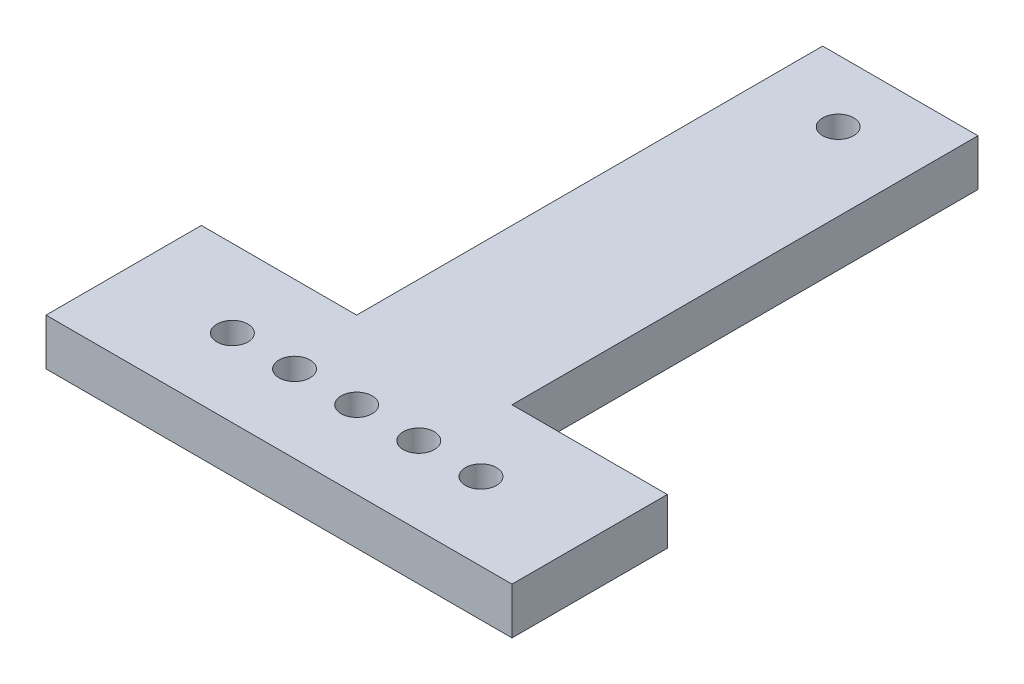
ISO-10303-21;
HEADER;
FILE_DESCRIPTION(('STEP AP214'),'2;1');
FILE_NAME('part.step','',(''),(''),'','','');
FILE_SCHEMA(('AUTOMOTIVE_DESIGN { 1 0 10303 214 1 1 1 1 }'));
ENDSEC;
DATA;
#1=APPLICATION_CONTEXT('core data for automotive mechanical design processes');
#2=APPLICATION_PROTOCOL_DEFINITION('international standard','automotive_design',2000,#1);
#3=PRODUCT_CONTEXT('',#1,'mechanical');
#4=PRODUCT('Part','Part','',(#3));
#5=PRODUCT_RELATED_PRODUCT_CATEGORY('part','',(#4));
#6=PRODUCT_DEFINITION_FORMATION('','',#4);
#7=PRODUCT_DEFINITION_CONTEXT('part definition',#1,'design');
#8=PRODUCT_DEFINITION('design','',#6,#7);
#9=PRODUCT_DEFINITION_SHAPE('','',#8);
#10=(LENGTH_UNIT() NAMED_UNIT(*) SI_UNIT(.MILLI.,.METRE.));
#11=(NAMED_UNIT(*) PLANE_ANGLE_UNIT() SI_UNIT($,.RADIAN.));
#12=(NAMED_UNIT(*) SI_UNIT($,.STERADIAN.) SOLID_ANGLE_UNIT());
#13=UNCERTAINTY_MEASURE_WITH_UNIT(LENGTH_MEASURE(1.E-05),#10,'distance_accuracy_value','');
#14=(GEOMETRIC_REPRESENTATION_CONTEXT(3) GLOBAL_UNCERTAINTY_ASSIGNED_CONTEXT((#13)) GLOBAL_UNIT_ASSIGNED_CONTEXT((#10,
#11,#12)) REPRESENTATION_CONTEXT('',''));
#15=CARTESIAN_POINT('',(0.,0.,0.));
#16=DIRECTION('',(0.,0.,1.));
#17=DIRECTION('',(1.,0.,0.));
#18=AXIS2_PLACEMENT_3D('',#15,#16,#17);
#19=CARTESIAN_POINT('',(50.,15.,0.));
#20=DIRECTION('',(-1.,0.,0.));
#21=DIRECTION('',(0.,0.,1.));
#22=AXIS2_PLACEMENT_3D('',#19,#20,#21);
#23=PLANE('',#22);
#24=DIRECTION('',(0.,1.,0.));
#25=VECTOR('',#24,1.);
#26=CARTESIAN_POINT('',(50.,15.,-50.));
#27=LINE('',#26,#25);
#28=CARTESIAN_POINT('',(50.,0.,-50.));
#29=VERTEX_POINT('',#28);
#30=CARTESIAN_POINT('',(50.,15.,-50.));
#31=VERTEX_POINT('',#30);
#32=EDGE_CURVE('E59',#29,#31,#27,.T.);
#33=ORIENTED_EDGE('',*,*,#32,.F.);
#34=DIRECTION('',(0.,0.,-1.));
#35=VECTOR('',#34,1.);
#36=CARTESIAN_POINT('',(50.,0.,0.));
#37=LINE('',#36,#35);
#38=CARTESIAN_POINT('',(50.,0.,-200.));
#39=VERTEX_POINT('',#38);
#40=EDGE_CURVE('E167',#29,#39,#37,.T.);
#41=ORIENTED_EDGE('',*,*,#40,.T.);
#42=DIRECTION('',(0.,-1.,0.));
#43=VECTOR('',#42,1.);
#44=CARTESIAN_POINT('',(50.,15.,-200.));
#45=LINE('',#44,#43);
#46=CARTESIAN_POINT('',(50.,15.,-200.));
#47=VERTEX_POINT('',#46);
#48=EDGE_CURVE('E11',#47,#39,#45,.T.);
#49=ORIENTED_EDGE('',*,*,#48,.F.);
#50=DIRECTION('',(0.,0.,-1.));
#51=VECTOR('',#50,1.);
#52=CARTESIAN_POINT('',(50.,15.,0.));
#53=LINE('',#52,#51);
#54=EDGE_CURVE('E110',#31,#47,#53,.T.);
#55=ORIENTED_EDGE('',*,*,#54,.F.);
#56=EDGE_LOOP('',(#33,#41,#49,#55));
#57=FACE_BOUND('',#56,.T.);
#58=ADVANCED_FACE('F36',(#57),#23,.F.);
#59=CARTESIAN_POINT('',(0.,15.,0.));
#60=DIRECTION('',(0.,0.,-1.));
#61=DIRECTION('',(-1.,0.,0.));
#62=AXIS2_PLACEMENT_3D('',#59,#60,#61);
#63=PLANE('',#62);
#64=DIRECTION('',(1.,0.,0.));
#65=VECTOR('',#64,1.);
#66=CARTESIAN_POINT('',(0.,0.,0.));
#67=LINE('',#66,#65);
#68=CARTESIAN_POINT('',(-50.,0.,0.));
#69=VERTEX_POINT('',#68);
#70=CARTESIAN_POINT('',(100.,0.,0.));
#71=VERTEX_POINT('',#70);
#72=EDGE_CURVE('E157',#69,#71,#67,.T.);
#73=ORIENTED_EDGE('',*,*,#72,.T.);
#74=DIRECTION('',(0.,-1.,0.));
#75=VECTOR('',#74,1.);
#76=CARTESIAN_POINT('',(100.,0.,0.));
#77=LINE('',#76,#75);
#78=CARTESIAN_POINT('',(100.,15.,0.));
#79=VERTEX_POINT('',#78);
#80=EDGE_CURVE('E106',#79,#71,#77,.T.);
#81=ORIENTED_EDGE('',*,*,#80,.F.);
#82=DIRECTION('',(1.,0.,0.));
#83=VECTOR('',#82,1.);
#84=CARTESIAN_POINT('',(0.,15.,0.));
#85=LINE('',#84,#83);
#86=CARTESIAN_POINT('',(-50.,15.,0.));
#87=VERTEX_POINT('',#86);
#88=EDGE_CURVE('E101',#87,#79,#85,.T.);
#89=ORIENTED_EDGE('',*,*,#88,.F.);
#90=DIRECTION('',(0.,1.,0.));
#91=VECTOR('',#90,1.);
#92=CARTESIAN_POINT('',(-50.,15.,0.));
#93=LINE('',#92,#91);
#94=EDGE_CURVE('E104',#69,#87,#93,.T.);
#95=ORIENTED_EDGE('',*,*,#94,.F.);
#96=EDGE_LOOP('',(#73,#81,#89,#95));
#97=FACE_BOUND('',#96,.T.);
#98=ADVANCED_FACE('F38',(#97),#63,.F.);
#99=CARTESIAN_POINT('',(0.,15.,-200.));
#100=DIRECTION('',(0.,0.,-1.));
#101=DIRECTION('',(-1.,0.,0.));
#102=AXIS2_PLACEMENT_3D('',#99,#100,#101);
#103=PLANE('',#102);
#104=DIRECTION('',(1.,0.,0.));
#105=VECTOR('',#104,1.);
#106=CARTESIAN_POINT('',(0.,0.,-200.));
#107=LINE('',#106,#105);
#108=CARTESIAN_POINT('',(0.,0.,-200.));
#109=VERTEX_POINT('',#108);
#110=EDGE_CURVE('E169',#109,#39,#107,.T.);
#111=ORIENTED_EDGE('',*,*,#110,.F.);
#112=DIRECTION('',(0.,-1.,0.));
#113=VECTOR('',#112,1.);
#114=CARTESIAN_POINT('',(0.,15.,-200.));
#115=LINE('',#114,#113);
#116=CARTESIAN_POINT('',(0.,15.,-200.));
#117=VERTEX_POINT('',#116);
#118=EDGE_CURVE('E44',#117,#109,#115,.T.);
#119=ORIENTED_EDGE('',*,*,#118,.F.);
#120=DIRECTION('',(1.,0.,0.));
#121=VECTOR('',#120,1.);
#122=CARTESIAN_POINT('',(0.,15.,-200.));
#123=LINE('',#122,#121);
#124=EDGE_CURVE('E161',#117,#47,#123,.T.);
#125=ORIENTED_EDGE('',*,*,#124,.T.);
#126=ORIENTED_EDGE('',*,*,#48,.T.);
#127=EDGE_LOOP('',(#111,#119,#125,#126));
#128=FACE_BOUND('',#127,.T.);
#129=ADVANCED_FACE('F178',(#128),#103,.T.);
#130=CARTESIAN_POINT('',(0.,15.,0.));
#131=DIRECTION('',(-1.,0.,0.));
#132=DIRECTION('',(0.,0.,1.));
#133=AXIS2_PLACEMENT_3D('',#130,#131,#132);
#134=PLANE('',#133);
#135=DIRECTION('',(0.,-1.,0.));
#136=VECTOR('',#135,1.);
#137=CARTESIAN_POINT('',(0.,15.,-50.));
#138=LINE('',#137,#136);
#139=CARTESIAN_POINT('',(0.,15.,-50.));
#140=VERTEX_POINT('',#139);
#141=CARTESIAN_POINT('',(0.,0.,-50.));
#142=VERTEX_POINT('',#141);
#143=EDGE_CURVE('E51',#140,#142,#138,.T.);
#144=ORIENTED_EDGE('',*,*,#143,.F.);
#145=DIRECTION('',(0.,0.,-1.));
#146=VECTOR('',#145,1.);
#147=CARTESIAN_POINT('',(0.,15.,0.));
#148=LINE('',#147,#146);
#149=EDGE_CURVE('E164',#140,#117,#148,.T.);
#150=ORIENTED_EDGE('',*,*,#149,.T.);
#151=ORIENTED_EDGE('',*,*,#118,.T.);
#152=DIRECTION('',(0.,0.,-1.));
#153=VECTOR('',#152,1.);
#154=CARTESIAN_POINT('',(0.,0.,0.));
#155=LINE('',#154,#153);
#156=EDGE_CURVE('E111',#142,#109,#155,.T.);
#157=ORIENTED_EDGE('',*,*,#156,.F.);
#158=EDGE_LOOP('',(#144,#150,#151,#157));
#159=FACE_BOUND('',#158,.T.);
#160=ADVANCED_FACE('F175',(#159),#134,.T.);
#161=CARTESIAN_POINT('',(0.,15.,0.));
#162=DIRECTION('',(0.,1.,0.));
#163=DIRECTION('',(0.,0.,1.));
#164=AXIS2_PLACEMENT_3D('',#161,#162,#163);
#165=PLANE('',#164);
#166=CARTESIAN_POINT('',(5.,15.,-24.9999999999999));
#167=DIRECTION('',(0.,1.,0.));
#168=DIRECTION('',(0.,0.,1.));
#169=AXIS2_PLACEMENT_3D('',#166,#167,#168);
#170=CIRCLE('',#169,5.);
#171=CARTESIAN_POINT('',(5.,15.,-19.9999999999999));
#172=VERTEX_POINT('',#171);
#173=EDGE_CURVE('E328',#172,#172,#170,.T.);
#174=ORIENTED_EDGE('',*,*,#173,.F.);
#175=EDGE_LOOP('',(#174));
#176=FACE_BOUND('',#175,.T.);
#177=CARTESIAN_POINT('',(45.,15.,-25.));
#178=DIRECTION('',(0.,1.,0.));
#179=DIRECTION('',(0.,0.,1.));
#180=AXIS2_PLACEMENT_3D('',#177,#178,#179);
#181=CIRCLE('',#180,5.);
#182=CARTESIAN_POINT('',(45.,15.,-20.));
#183=VERTEX_POINT('',#182);
#184=EDGE_CURVE('E331',#183,#183,#181,.T.);
#185=ORIENTED_EDGE('',*,*,#184,.F.);
#186=EDGE_LOOP('',(#185));
#187=FACE_BOUND('',#186,.T.);
#188=CARTESIAN_POINT('',(65.,15.,-25.));
#189=DIRECTION('',(0.,1.,0.));
#190=DIRECTION('',(0.,0.,1.));
#191=AXIS2_PLACEMENT_3D('',#188,#189,#190);
#192=CIRCLE('',#191,5.);
#193=CARTESIAN_POINT('',(65.,15.,-20.));
#194=VERTEX_POINT('',#193);
#195=EDGE_CURVE('E341',#194,#194,#192,.T.);
#196=ORIENTED_EDGE('',*,*,#195,.F.);
#197=EDGE_LOOP('',(#196));
#198=FACE_BOUND('',#197,.T.);
#199=CARTESIAN_POINT('',(-15.,15.,-24.9999999999997));
#200=DIRECTION('',(0.,1.,0.));
#201=DIRECTION('',(0.,0.,1.));
#202=AXIS2_PLACEMENT_3D('',#199,#200,#201);
#203=CIRCLE('',#202,5.);
#204=CARTESIAN_POINT('',(-15.,15.,-19.9999999999997));
#205=VERTEX_POINT('',#204);
#206=EDGE_CURVE('E361',#205,#205,#203,.T.);
#207=ORIENTED_EDGE('',*,*,#206,.F.);
#208=EDGE_LOOP('',(#207));
#209=FACE_BOUND('',#208,.T.);
#210=CARTESIAN_POINT('',(25.,15.,-25.));
#211=DIRECTION('',(0.,1.,0.));
#212=DIRECTION('',(0.,0.,1.));
#213=AXIS2_PLACEMENT_3D('',#210,#211,#212);
#214=CIRCLE('',#213,5.);
#215=CARTESIAN_POINT('',(25.,15.,-20.));
#216=VERTEX_POINT('',#215);
#217=EDGE_CURVE('E130',#216,#216,#214,.T.);
#218=ORIENTED_EDGE('',*,*,#217,.F.);
#219=EDGE_LOOP('',(#218));
#220=FACE_BOUND('',#219,.T.);
#221=CARTESIAN_POINT('',(25.,15.,-180.));
#222=DIRECTION('',(0.,1.,0.));
#223=DIRECTION('',(0.,0.,1.));
#224=AXIS2_PLACEMENT_3D('',#221,#222,#223);
#225=CIRCLE('',#224,5.);
#226=CARTESIAN_POINT('',(25.,15.,-175.));
#227=VERTEX_POINT('',#226);
#228=EDGE_CURVE('E153',#227,#227,#225,.T.);
#229=ORIENTED_EDGE('',*,*,#228,.F.);
#230=EDGE_LOOP('',(#229));
#231=FACE_BOUND('',#230,.T.);
#232=ORIENTED_EDGE('',*,*,#88,.T.);
#233=DIRECTION('',(0.,0.,1.));
#234=VECTOR('',#233,1.);
#235=CARTESIAN_POINT('',(100.,15.,0.));
#236=LINE('',#235,#234);
#237=CARTESIAN_POINT('',(100.,15.,-50.));
#238=VERTEX_POINT('',#237);
#239=EDGE_CURVE('E144',#238,#79,#236,.T.);
#240=ORIENTED_EDGE('',*,*,#239,.F.);
#241=DIRECTION('',(-1.,0.,0.));
#242=VECTOR('',#241,1.);
#243=CARTESIAN_POINT('',(100.,15.,-50.));
#244=LINE('',#243,#242);
#245=EDGE_CURVE('E146',#238,#31,#244,.T.);
#246=ORIENTED_EDGE('',*,*,#245,.T.);
#247=ORIENTED_EDGE('',*,*,#54,.T.);
#248=ORIENTED_EDGE('',*,*,#124,.F.);
#249=ORIENTED_EDGE('',*,*,#149,.F.);
#250=DIRECTION('',(1.,0.,0.));
#251=VECTOR('',#250,1.);
#252=CARTESIAN_POINT('',(-50.,15.,-50.));
#253=LINE('',#252,#251);
#254=CARTESIAN_POINT('',(-50.,15.,-50.));
#255=VERTEX_POINT('',#254);
#256=EDGE_CURVE('E117',#255,#140,#253,.T.);
#257=ORIENTED_EDGE('',*,*,#256,.F.);
#258=DIRECTION('',(0.,0.,-1.));
#259=VECTOR('',#258,1.);
#260=CARTESIAN_POINT('',(-50.,15.,0.));
#261=LINE('',#260,#259);
#262=EDGE_CURVE('E114',#87,#255,#261,.T.);
#263=ORIENTED_EDGE('',*,*,#262,.F.);
#264=EDGE_LOOP('',(#232,#240,#246,#247,#248,#249,#257,#263));
#265=FACE_BOUND('',#264,.T.);
#266=ADVANCED_FACE('F115',(#176,#187,#198,#209,#220,#231,#265),#165,.T.);
#267=CARTESIAN_POINT('',(0.,0.,0.));
#268=DIRECTION('',(0.,1.,0.));
#269=DIRECTION('',(0.,0.,1.));
#270=AXIS2_PLACEMENT_3D('',#267,#268,#269);
#271=PLANE('',#270);
#272=CARTESIAN_POINT('',(5.,0.,-24.9999999999999));
#273=DIRECTION('',(0.,1.,0.));
#274=DIRECTION('',(0.,0.,1.));
#275=AXIS2_PLACEMENT_3D('',#272,#273,#274);
#276=CIRCLE('',#275,5.);
#277=CARTESIAN_POINT('',(5.,0.,-19.9999999999999));
#278=VERTEX_POINT('',#277);
#279=EDGE_CURVE('E325',#278,#278,#276,.T.);
#280=ORIENTED_EDGE('',*,*,#279,.T.);
#281=EDGE_LOOP('',(#280));
#282=FACE_BOUND('',#281,.T.);
#283=CARTESIAN_POINT('',(45.,0.,-25.));
#284=DIRECTION('',(0.,1.,0.));
#285=DIRECTION('',(0.,0.,1.));
#286=AXIS2_PLACEMENT_3D('',#283,#284,#285);
#287=CIRCLE('',#286,5.);
#288=CARTESIAN_POINT('',(45.,0.,-20.));
#289=VERTEX_POINT('',#288);
#290=EDGE_CURVE('E339',#289,#289,#287,.T.);
#291=ORIENTED_EDGE('',*,*,#290,.T.);
#292=EDGE_LOOP('',(#291));
#293=FACE_BOUND('',#292,.T.);
#294=CARTESIAN_POINT('',(65.,0.,-25.));
#295=DIRECTION('',(0.,1.,0.));
#296=DIRECTION('',(0.,0.,1.));
#297=AXIS2_PLACEMENT_3D('',#294,#295,#296);
#298=CIRCLE('',#297,5.);
#299=CARTESIAN_POINT('',(65.,0.,-20.));
#300=VERTEX_POINT('',#299);
#301=EDGE_CURVE('E356',#300,#300,#298,.T.);
#302=ORIENTED_EDGE('',*,*,#301,.T.);
#303=EDGE_LOOP('',(#302));
#304=FACE_BOUND('',#303,.T.);
#305=CARTESIAN_POINT('',(-15.,0.,-24.9999999999997));
#306=DIRECTION('',(0.,1.,0.));
#307=DIRECTION('',(0.,0.,1.));
#308=AXIS2_PLACEMENT_3D('',#305,#306,#307);
#309=CIRCLE('',#308,5.);
#310=CARTESIAN_POINT('',(-15.,0.,-19.9999999999997));
#311=VERTEX_POINT('',#310);
#312=EDGE_CURVE('E334',#311,#311,#309,.T.);
#313=ORIENTED_EDGE('',*,*,#312,.T.);
#314=EDGE_LOOP('',(#313));
#315=FACE_BOUND('',#314,.T.);
#316=CARTESIAN_POINT('',(25.,0.,-25.));
#317=DIRECTION('',(0.,1.,0.));
#318=DIRECTION('',(0.,0.,1.));
#319=AXIS2_PLACEMENT_3D('',#316,#317,#318);
#320=CIRCLE('',#319,5.);
#321=CARTESIAN_POINT('',(25.,0.,-20.));
#322=VERTEX_POINT('',#321);
#323=EDGE_CURVE('E127',#322,#322,#320,.T.);
#324=ORIENTED_EDGE('',*,*,#323,.T.);
#325=EDGE_LOOP('',(#324));
#326=FACE_BOUND('',#325,.T.);
#327=CARTESIAN_POINT('',(25.,0.,-180.));
#328=DIRECTION('',(0.,1.,0.));
#329=DIRECTION('',(0.,0.,1.));
#330=AXIS2_PLACEMENT_3D('',#327,#328,#329);
#331=CIRCLE('',#330,5.);
#332=CARTESIAN_POINT('',(25.,0.,-175.));
#333=VERTEX_POINT('',#332);
#334=EDGE_CURVE('E154',#333,#333,#331,.T.);
#335=ORIENTED_EDGE('',*,*,#334,.T.);
#336=EDGE_LOOP('',(#335));
#337=FACE_BOUND('',#336,.T.);
#338=ORIENTED_EDGE('',*,*,#72,.F.);
#339=DIRECTION('',(0.,0.,1.));
#340=VECTOR('',#339,1.);
#341=CARTESIAN_POINT('',(-50.,0.,0.));
#342=LINE('',#341,#340);
#343=CARTESIAN_POINT('',(-50.,0.,-50.));
#344=VERTEX_POINT('',#343);
#345=EDGE_CURVE('E125',#344,#69,#342,.T.);
#346=ORIENTED_EDGE('',*,*,#345,.F.);
#347=DIRECTION('',(1.,0.,0.));
#348=VECTOR('',#347,1.);
#349=CARTESIAN_POINT('',(-50.,0.,-50.));
#350=LINE('',#349,#348);
#351=EDGE_CURVE('E134',#344,#142,#350,.T.);
#352=ORIENTED_EDGE('',*,*,#351,.T.);
#353=ORIENTED_EDGE('',*,*,#156,.T.);
#354=ORIENTED_EDGE('',*,*,#110,.T.);
#355=ORIENTED_EDGE('',*,*,#40,.F.);
#356=DIRECTION('',(-1.,0.,0.));
#357=VECTOR('',#356,1.);
#358=CARTESIAN_POINT('',(100.,0.,-50.));
#359=LINE('',#358,#357);
#360=CARTESIAN_POINT('',(100.,0.,-50.));
#361=VERTEX_POINT('',#360);
#362=EDGE_CURVE('E150',#361,#29,#359,.T.);
#363=ORIENTED_EDGE('',*,*,#362,.F.);
#364=DIRECTION('',(0.,0.,-1.));
#365=VECTOR('',#364,1.);
#366=CARTESIAN_POINT('',(100.,0.,-50.));
#367=LINE('',#366,#365);
#368=EDGE_CURVE('E140',#71,#361,#367,.T.);
#369=ORIENTED_EDGE('',*,*,#368,.F.);
#370=EDGE_LOOP('',(#338,#346,#352,#353,#354,#355,#363,#369));
#371=FACE_BOUND('',#370,.T.);
#372=ADVANCED_FACE('F181',(#282,#293,#304,#315,#326,#337,#371),#271,.F.);
#373=CARTESIAN_POINT('',(25.,0.,-180.));
#374=DIRECTION('',(0.,1.,0.));
#375=DIRECTION('',(0.,0.,1.));
#376=AXIS2_PLACEMENT_3D('',#373,#374,#375);
#377=CYLINDRICAL_SURFACE('',#376,5.);
#378=ORIENTED_EDGE('',*,*,#334,.F.);
#379=EDGE_LOOP('',(#378));
#380=FACE_BOUND('',#379,.T.);
#381=ORIENTED_EDGE('',*,*,#228,.T.);
#382=EDGE_LOOP('',(#381));
#383=FACE_BOUND('',#382,.T.);
#384=ADVANCED_FACE('F209',(#380,#383),#377,.F.);
#385=CARTESIAN_POINT('',(100.,15.,-50.));
#386=DIRECTION('',(0.,0.,1.));
#387=DIRECTION('',(1.,0.,0.));
#388=AXIS2_PLACEMENT_3D('',#385,#386,#387);
#389=PLANE('',#388);
#390=ORIENTED_EDGE('',*,*,#32,.T.);
#391=ORIENTED_EDGE('',*,*,#245,.F.);
#392=DIRECTION('',(0.,1.,0.));
#393=VECTOR('',#392,1.);
#394=CARTESIAN_POINT('',(100.,15.,-50.));
#395=LINE('',#394,#393);
#396=EDGE_CURVE('E142',#361,#238,#395,.T.);
#397=ORIENTED_EDGE('',*,*,#396,.F.);
#398=ORIENTED_EDGE('',*,*,#362,.T.);
#399=EDGE_LOOP('',(#390,#391,#397,#398));
#400=FACE_BOUND('',#399,.T.);
#401=ADVANCED_FACE('F195',(#400),#389,.F.);
#402=CARTESIAN_POINT('',(100.,0.,0.));
#403=DIRECTION('',(-1.,0.,0.));
#404=DIRECTION('',(0.,0.,1.));
#405=AXIS2_PLACEMENT_3D('',#402,#403,#404);
#406=PLANE('',#405);
#407=ORIENTED_EDGE('',*,*,#80,.T.);
#408=ORIENTED_EDGE('',*,*,#368,.T.);
#409=ORIENTED_EDGE('',*,*,#396,.T.);
#410=ORIENTED_EDGE('',*,*,#239,.T.);
#411=EDGE_LOOP('',(#407,#408,#409,#410));
#412=FACE_BOUND('',#411,.T.);
#413=ADVANCED_FACE('F187',(#412),#406,.F.);
#414=CARTESIAN_POINT('',(-50.,15.,-50.));
#415=DIRECTION('',(0.,0.,1.));
#416=DIRECTION('',(1.,0.,0.));
#417=AXIS2_PLACEMENT_3D('',#414,#415,#416);
#418=PLANE('',#417);
#419=ORIENTED_EDGE('',*,*,#143,.T.);
#420=ORIENTED_EDGE('',*,*,#351,.F.);
#421=DIRECTION('',(0.,-1.,0.));
#422=VECTOR('',#421,1.);
#423=CARTESIAN_POINT('',(-50.,15.,-50.));
#424=LINE('',#423,#422);
#425=EDGE_CURVE('E120',#255,#344,#424,.T.);
#426=ORIENTED_EDGE('',*,*,#425,.F.);
#427=ORIENTED_EDGE('',*,*,#256,.T.);
#428=EDGE_LOOP('',(#419,#420,#426,#427));
#429=FACE_BOUND('',#428,.T.);
#430=ADVANCED_FACE('F185',(#429),#418,.F.);
#431=CARTESIAN_POINT('',(-50.,0.,0.));
#432=DIRECTION('',(1.,0.,0.));
#433=DIRECTION('',(0.,0.,-1.));
#434=AXIS2_PLACEMENT_3D('',#431,#432,#433);
#435=PLANE('',#434);
#436=ORIENTED_EDGE('',*,*,#94,.T.);
#437=ORIENTED_EDGE('',*,*,#262,.T.);
#438=ORIENTED_EDGE('',*,*,#425,.T.);
#439=ORIENTED_EDGE('',*,*,#345,.T.);
#440=EDGE_LOOP('',(#436,#437,#438,#439));
#441=FACE_BOUND('',#440,.T.);
#442=ADVANCED_FACE('F123',(#441),#435,.F.);
#443=CARTESIAN_POINT('',(25.,0.,-25.));
#444=DIRECTION('',(0.,1.,0.));
#445=DIRECTION('',(0.,0.,1.));
#446=AXIS2_PLACEMENT_3D('',#443,#444,#445);
#447=CYLINDRICAL_SURFACE('',#446,5.);
#448=ORIENTED_EDGE('',*,*,#323,.F.);
#449=EDGE_LOOP('',(#448));
#450=FACE_BOUND('',#449,.T.);
#451=ORIENTED_EDGE('',*,*,#217,.T.);
#452=EDGE_LOOP('',(#451));
#453=FACE_BOUND('',#452,.T.);
#454=ADVANCED_FACE('F193',(#450,#453),#447,.F.);
#455=CARTESIAN_POINT('',(-15.,0.,-24.9999999999997));
#456=DIRECTION('',(0.,1.,0.));
#457=DIRECTION('',(0.,0.,1.));
#458=AXIS2_PLACEMENT_3D('',#455,#456,#457);
#459=CYLINDRICAL_SURFACE('',#458,5.);
#460=ORIENTED_EDGE('',*,*,#312,.F.);
#461=EDGE_LOOP('',(#460));
#462=FACE_BOUND('',#461,.T.);
#463=ORIENTED_EDGE('',*,*,#206,.T.);
#464=EDGE_LOOP('',(#463));
#465=FACE_BOUND('',#464,.T.);
#466=ADVANCED_FACE('F278',(#462,#465),#459,.F.);
#467=CARTESIAN_POINT('',(65.,0.,-25.));
#468=DIRECTION('',(0.,1.,0.));
#469=DIRECTION('',(0.,0.,1.));
#470=AXIS2_PLACEMENT_3D('',#467,#468,#469);
#471=CYLINDRICAL_SURFACE('',#470,5.);
#472=ORIENTED_EDGE('',*,*,#301,.F.);
#473=EDGE_LOOP('',(#472));
#474=FACE_BOUND('',#473,.T.);
#475=ORIENTED_EDGE('',*,*,#195,.T.);
#476=EDGE_LOOP('',(#475));
#477=FACE_BOUND('',#476,.T.);
#478=ADVANCED_FACE('F288',(#474,#477),#471,.F.);
#479=CARTESIAN_POINT('',(45.,0.,-25.));
#480=DIRECTION('',(0.,1.,0.));
#481=DIRECTION('',(0.,0.,1.));
#482=AXIS2_PLACEMENT_3D('',#479,#480,#481);
#483=CYLINDRICAL_SURFACE('',#482,5.);
#484=ORIENTED_EDGE('',*,*,#290,.F.);
#485=EDGE_LOOP('',(#484));
#486=FACE_BOUND('',#485,.T.);
#487=ORIENTED_EDGE('',*,*,#184,.T.);
#488=EDGE_LOOP('',(#487));
#489=FACE_BOUND('',#488,.T.);
#490=ADVANCED_FACE('F298',(#486,#489),#483,.F.);
#491=CARTESIAN_POINT('',(5.,0.,-24.9999999999999));
#492=DIRECTION('',(0.,1.,0.));
#493=DIRECTION('',(0.,0.,1.));
#494=AXIS2_PLACEMENT_3D('',#491,#492,#493);
#495=CYLINDRICAL_SURFACE('',#494,5.);
#496=ORIENTED_EDGE('',*,*,#279,.F.);
#497=EDGE_LOOP('',(#496));
#498=FACE_BOUND('',#497,.T.);
#499=ORIENTED_EDGE('',*,*,#173,.T.);
#500=EDGE_LOOP('',(#499));
#501=FACE_BOUND('',#500,.T.);
#502=ADVANCED_FACE('F308',(#498,#501),#495,.F.);
#503=CLOSED_SHELL('',(#58,#98,#129,#160,#266,#372,#384,#401,#413,#430,#442,#454,#466,#478,#490,#502));
#504=MANIFOLD_SOLID_BREP('B2',#503);
#505=ADVANCED_BREP_SHAPE_REPRESENTATION('',(#18,#504),#14);
#506=SHAPE_DEFINITION_REPRESENTATION(#9,#505);
ENDSEC;
END-ISO-10303-21;
